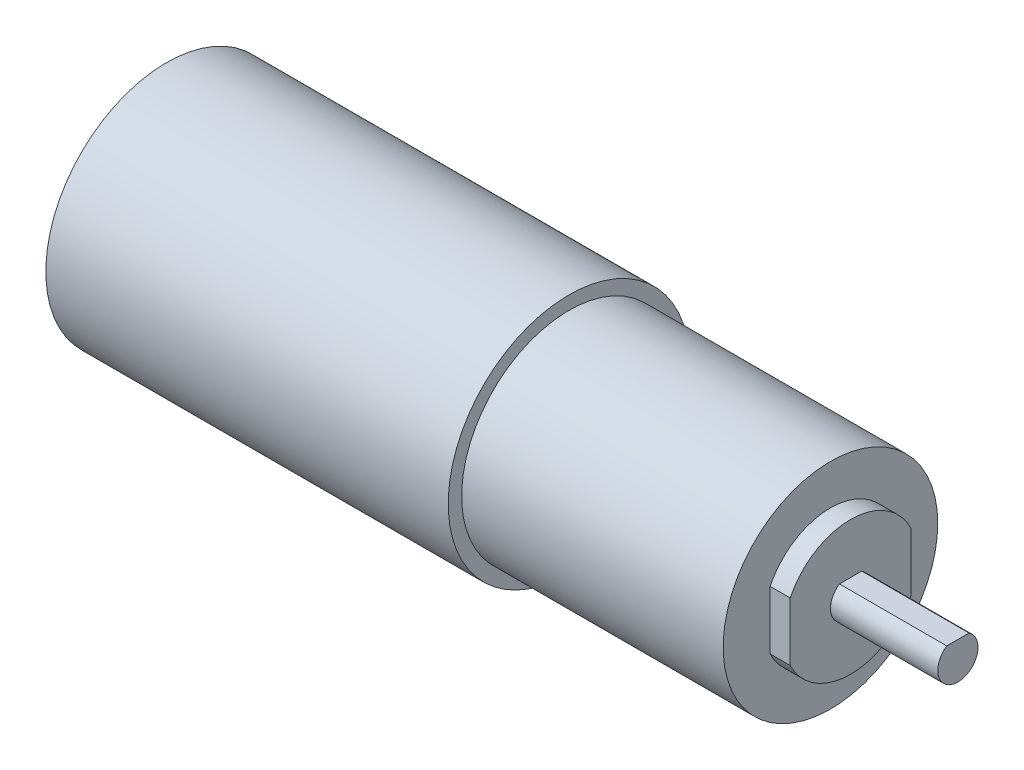
ISO-10303-21;
HEADER;
FILE_DESCRIPTION(('STEP AP214'),'2;1');
FILE_NAME('part.step','',(''),(''),'','','');
FILE_SCHEMA(('AUTOMOTIVE_DESIGN { 1 0 10303 214 1 1 1 1 }'));
ENDSEC;
DATA;
#1=APPLICATION_CONTEXT('core data for automotive mechanical design processes');
#2=APPLICATION_PROTOCOL_DEFINITION('international standard','automotive_design',2000,#1);
#3=PRODUCT_CONTEXT('',#1,'mechanical');
#4=PRODUCT('Part','Part','',(#3));
#5=PRODUCT_RELATED_PRODUCT_CATEGORY('part','',(#4));
#6=PRODUCT_DEFINITION_FORMATION('','',#4);
#7=PRODUCT_DEFINITION_CONTEXT('part definition',#1,'design');
#8=PRODUCT_DEFINITION('design','',#6,#7);
#9=PRODUCT_DEFINITION_SHAPE('','',#8);
#10=(LENGTH_UNIT() NAMED_UNIT(*) SI_UNIT(.MILLI.,.METRE.));
#11=(NAMED_UNIT(*) PLANE_ANGLE_UNIT() SI_UNIT($,.RADIAN.));
#12=(NAMED_UNIT(*) SI_UNIT($,.STERADIAN.) SOLID_ANGLE_UNIT());
#13=UNCERTAINTY_MEASURE_WITH_UNIT(LENGTH_MEASURE(1.E-05),#10,'distance_accuracy_value','');
#14=(GEOMETRIC_REPRESENTATION_CONTEXT(3) GLOBAL_UNCERTAINTY_ASSIGNED_CONTEXT((#13)) GLOBAL_UNIT_ASSIGNED_CONTEXT((#10,
#11,#12)) REPRESENTATION_CONTEXT('',''));
#15=CARTESIAN_POINT('',(0.,0.,0.));
#16=DIRECTION('',(0.,0.,1.));
#17=DIRECTION('',(1.,0.,0.));
#18=AXIS2_PLACEMENT_3D('',#15,#16,#17);
#19=CARTESIAN_POINT('',(60.,0.,0.));
#20=DIRECTION('',(-1.,0.,0.));
#21=DIRECTION('',(0.,0.,1.));
#22=AXIS2_PLACEMENT_3D('',#19,#20,#21);
#23=CYLINDRICAL_SURFACE('',#22,18.);
#24=CARTESIAN_POINT('',(60.,0.,0.));
#25=DIRECTION('',(1.,0.,0.));
#26=DIRECTION('',(0.,0.,-1.));
#27=AXIS2_PLACEMENT_3D('',#24,#25,#26);
#28=CIRCLE('',#27,18.);
#29=CARTESIAN_POINT('',(60.,0.,-18.));
#30=VERTEX_POINT('',#29);
#31=EDGE_CURVE('E144',#30,#30,#28,.T.);
#32=ORIENTED_EDGE('',*,*,#31,.F.);
#33=EDGE_LOOP('',(#32));
#34=FACE_BOUND('',#33,.T.);
#35=CARTESIAN_POINT('',(0.,0.,0.));
#36=DIRECTION('',(1.,0.,0.));
#37=DIRECTION('',(0.,0.,-1.));
#38=AXIS2_PLACEMENT_3D('',#35,#36,#37);
#39=CIRCLE('',#38,18.);
#40=CARTESIAN_POINT('',(0.,0.,-18.));
#41=VERTEX_POINT('',#40);
#42=EDGE_CURVE('E36',#41,#41,#39,.T.);
#43=ORIENTED_EDGE('',*,*,#42,.T.);
#44=EDGE_LOOP('',(#43));
#45=FACE_BOUND('',#44,.T.);
#46=ADVANCED_FACE('F33',(#34,#45),#23,.T.);
#47=CARTESIAN_POINT('',(60.,0.,0.));
#48=DIRECTION('',(1.,0.,0.));
#49=DIRECTION('',(0.,0.,-1.));
#50=AXIS2_PLACEMENT_3D('',#47,#48,#49);
#51=PLANE('',#50);
#52=CARTESIAN_POINT('',(60.,0.,0.));
#53=DIRECTION('',(1.,0.,0.));
#54=DIRECTION('',(0.,0.,-1.));
#55=AXIS2_PLACEMENT_3D('',#52,#53,#54);
#56=CIRCLE('',#55,16.);
#57=CARTESIAN_POINT('',(60.,0.,-16.));
#58=VERTEX_POINT('',#57);
#59=EDGE_CURVE('E11',#58,#58,#56,.T.);
#60=ORIENTED_EDGE('',*,*,#59,.F.);
#61=EDGE_LOOP('',(#60));
#62=FACE_BOUND('',#61,.T.);
#63=ORIENTED_EDGE('',*,*,#31,.T.);
#64=EDGE_LOOP('',(#63));
#65=FACE_BOUND('',#64,.T.);
#66=ADVANCED_FACE('F155',(#62,#65),#51,.T.);
#67=CARTESIAN_POINT('',(0.,0.,0.));
#68=DIRECTION('',(1.,0.,0.));
#69=DIRECTION('',(0.,0.,-1.));
#70=AXIS2_PLACEMENT_3D('',#67,#68,#69);
#71=PLANE('',#70);
#72=CARTESIAN_POINT('',(0.,0.,0.));
#73=DIRECTION('',(-1.,0.,0.));
#74=DIRECTION('',(0.,0.,1.));
#75=AXIS2_PLACEMENT_3D('',#72,#73,#74);
#76=CIRCLE('',#75,8.);
#77=CARTESIAN_POINT('',(0.,0.,8.));
#78=VERTEX_POINT('',#77);
#79=EDGE_CURVE('E41',#78,#78,#76,.T.);
#80=ORIENTED_EDGE('',*,*,#79,.F.);
#81=EDGE_LOOP('',(#80));
#82=FACE_BOUND('',#81,.T.);
#83=ORIENTED_EDGE('',*,*,#42,.F.);
#84=EDGE_LOOP('',(#83));
#85=FACE_BOUND('',#84,.T.);
#86=ADVANCED_FACE('F152',(#82,#85),#71,.F.);
#87=CARTESIAN_POINT('',(-3.,0.,0.));
#88=DIRECTION('',(1.,0.,0.));
#89=DIRECTION('',(0.,0.,-1.));
#90=AXIS2_PLACEMENT_3D('',#87,#88,#89);
#91=CYLINDRICAL_SURFACE('',#90,8.);
#92=CARTESIAN_POINT('',(-3.,0.,0.));
#93=DIRECTION('',(-1.,0.,0.));
#94=DIRECTION('',(0.,0.,1.));
#95=AXIS2_PLACEMENT_3D('',#92,#93,#94);
#96=CIRCLE('',#95,8.);
#97=CARTESIAN_POINT('',(-3.,0.,8.));
#98=VERTEX_POINT('',#97);
#99=EDGE_CURVE('E139',#98,#98,#96,.T.);
#100=ORIENTED_EDGE('',*,*,#99,.F.);
#101=EDGE_LOOP('',(#100));
#102=FACE_BOUND('',#101,.T.);
#103=ORIENTED_EDGE('',*,*,#79,.T.);
#104=EDGE_LOOP('',(#103));
#105=FACE_BOUND('',#104,.T.);
#106=ADVANCED_FACE('F154',(#102,#105),#91,.T.);
#107=CARTESIAN_POINT('',(-3.,0.,0.));
#108=DIRECTION('',(-1.,0.,0.));
#109=DIRECTION('',(0.,0.,1.));
#110=AXIS2_PLACEMENT_3D('',#107,#108,#109);
#111=PLANE('',#110);
#112=ORIENTED_EDGE('',*,*,#99,.T.);
#113=EDGE_LOOP('',(#112));
#114=FACE_BOUND('',#113,.T.);
#115=ADVANCED_FACE('F161',(#114),#111,.T.);
#116=CARTESIAN_POINT('',(99.,0.,0.));
#117=DIRECTION('',(-1.,0.,0.));
#118=DIRECTION('',(0.,0.,1.));
#119=AXIS2_PLACEMENT_3D('',#116,#117,#118);
#120=CYLINDRICAL_SURFACE('',#119,16.);
#121=CARTESIAN_POINT('',(99.,0.,0.));
#122=DIRECTION('',(1.,0.,0.));
#123=DIRECTION('',(0.,0.,-1.));
#124=AXIS2_PLACEMENT_3D('',#121,#122,#123);
#125=CIRCLE('',#124,16.);
#126=CARTESIAN_POINT('',(99.,0.,-16.));
#127=VERTEX_POINT('',#126);
#128=EDGE_CURVE('E137',#127,#127,#125,.T.);
#129=ORIENTED_EDGE('',*,*,#128,.F.);
#130=EDGE_LOOP('',(#129));
#131=FACE_BOUND('',#130,.T.);
#132=ORIENTED_EDGE('',*,*,#59,.T.);
#133=EDGE_LOOP('',(#132));
#134=FACE_BOUND('',#133,.T.);
#135=ADVANCED_FACE('F186',(#131,#134),#120,.T.);
#136=CARTESIAN_POINT('',(99.,0.,0.));
#137=DIRECTION('',(1.,0.,0.));
#138=DIRECTION('',(0.,0.,-1.));
#139=AXIS2_PLACEMENT_3D('',#136,#137,#138);
#140=PLANE('',#139);
#141=CARTESIAN_POINT('',(99.,0.,0.));
#142=DIRECTION('',(1.,0.,0.));
#143=DIRECTION('',(0.,0.,-1.));
#144=AXIS2_PLACEMENT_3D('',#141,#142,#143);
#145=CIRCLE('',#144,10.);
#146=CARTESIAN_POINT('',(99.,4.35889894354067,-9.));
#147=VERTEX_POINT('',#146);
#148=CARTESIAN_POINT('',(99.,4.35889894354068,9.));
#149=VERTEX_POINT('',#148);
#150=EDGE_CURVE('E56',#147,#149,#145,.T.);
#151=ORIENTED_EDGE('',*,*,#150,.F.);
#152=DIRECTION('',(0.,1.,0.));
#153=VECTOR('',#152,1.);
#154=CARTESIAN_POINT('',(99.,4.35889894354067,-9.));
#155=LINE('',#154,#153);
#156=CARTESIAN_POINT('',(99.,-4.35889894354067,-9.));
#157=VERTEX_POINT('',#156);
#158=EDGE_CURVE('E113',#157,#147,#155,.T.);
#159=ORIENTED_EDGE('',*,*,#158,.F.);
#160=CARTESIAN_POINT('',(99.,0.,0.));
#161=DIRECTION('',(1.,0.,0.));
#162=DIRECTION('',(0.,0.,-1.));
#163=AXIS2_PLACEMENT_3D('',#160,#161,#162);
#164=CIRCLE('',#163,10.);
#165=CARTESIAN_POINT('',(99.,-4.35889894354067,9.));
#166=VERTEX_POINT('',#165);
#167=EDGE_CURVE('E122',#166,#157,#164,.T.);
#168=ORIENTED_EDGE('',*,*,#167,.F.);
#169=DIRECTION('',(0.,-1.,0.));
#170=VECTOR('',#169,1.);
#171=CARTESIAN_POINT('',(99.,4.35889894354068,9.));
#172=LINE('',#171,#170);
#173=EDGE_CURVE('E104',#149,#166,#172,.T.);
#174=ORIENTED_EDGE('',*,*,#173,.F.);
#175=EDGE_LOOP('',(#151,#159,#168,#174));
#176=FACE_BOUND('',#175,.T.);
#177=ORIENTED_EDGE('',*,*,#128,.T.);
#178=EDGE_LOOP('',(#177));
#179=FACE_BOUND('',#178,.T.);
#180=ADVANCED_FACE('F191',(#176,#179),#140,.T.);
#181=CARTESIAN_POINT('',(102.,0.,0.));
#182=DIRECTION('',(-1.,0.,0.));
#183=DIRECTION('',(0.,0.,1.));
#184=AXIS2_PLACEMENT_3D('',#181,#182,#183);
#185=CYLINDRICAL_SURFACE('',#184,10.);
#186=ORIENTED_EDGE('',*,*,#150,.T.);
#187=DIRECTION('',(-1.,0.,0.));
#188=VECTOR('',#187,1.);
#189=CARTESIAN_POINT('',(102.,4.35889894354068,9.));
#190=LINE('',#189,#188);
#191=CARTESIAN_POINT('',(102.,4.35889894354068,9.));
#192=VERTEX_POINT('',#191);
#193=EDGE_CURVE('E134',#192,#149,#190,.T.);
#194=ORIENTED_EDGE('',*,*,#193,.F.);
#195=CARTESIAN_POINT('',(102.,0.,0.));
#196=DIRECTION('',(1.,0.,0.));
#197=DIRECTION('',(0.,0.,-1.));
#198=AXIS2_PLACEMENT_3D('',#195,#196,#197);
#199=CIRCLE('',#198,10.);
#200=CARTESIAN_POINT('',(102.,4.35889894354067,-9.));
#201=VERTEX_POINT('',#200);
#202=EDGE_CURVE('E109',#201,#192,#199,.T.);
#203=ORIENTED_EDGE('',*,*,#202,.F.);
#204=DIRECTION('',(-1.,0.,0.));
#205=VECTOR('',#204,1.);
#206=CARTESIAN_POINT('',(102.,4.35889894354067,-9.));
#207=LINE('',#206,#205);
#208=EDGE_CURVE('E118',#201,#147,#207,.T.);
#209=ORIENTED_EDGE('',*,*,#208,.T.);
#210=EDGE_LOOP('',(#186,#194,#203,#209));
#211=FACE_BOUND('',#210,.T.);
#212=ADVANCED_FACE('F201',(#211),#185,.T.);
#213=CARTESIAN_POINT('',(102.,4.35889894354068,9.));
#214=DIRECTION('',(0.,0.,-1.));
#215=DIRECTION('',(-1.,0.,0.));
#216=AXIS2_PLACEMENT_3D('',#213,#214,#215);
#217=PLANE('',#216);
#218=ORIENTED_EDGE('',*,*,#173,.T.);
#219=DIRECTION('',(-1.,0.,0.));
#220=VECTOR('',#219,1.);
#221=CARTESIAN_POINT('',(102.,-4.35889894354067,9.));
#222=LINE('',#221,#220);
#223=CARTESIAN_POINT('',(102.,-4.35889894354067,9.));
#224=VERTEX_POINT('',#223);
#225=EDGE_CURVE('E131',#224,#166,#222,.T.);
#226=ORIENTED_EDGE('',*,*,#225,.F.);
#227=DIRECTION('',(0.,-1.,0.));
#228=VECTOR('',#227,1.);
#229=CARTESIAN_POINT('',(102.,4.35889894354068,9.));
#230=LINE('',#229,#228);
#231=EDGE_CURVE('E112',#192,#224,#230,.T.);
#232=ORIENTED_EDGE('',*,*,#231,.F.);
#233=ORIENTED_EDGE('',*,*,#193,.T.);
#234=EDGE_LOOP('',(#218,#226,#232,#233));
#235=FACE_BOUND('',#234,.T.);
#236=ADVANCED_FACE('F210',(#235),#217,.F.);
#237=CARTESIAN_POINT('',(102.,0.,0.));
#238=DIRECTION('',(-1.,0.,0.));
#239=DIRECTION('',(0.,0.,1.));
#240=AXIS2_PLACEMENT_3D('',#237,#238,#239);
#241=CYLINDRICAL_SURFACE('',#240,10.);
#242=ORIENTED_EDGE('',*,*,#167,.T.);
#243=DIRECTION('',(-1.,0.,0.));
#244=VECTOR('',#243,1.);
#245=CARTESIAN_POINT('',(102.,-4.35889894354067,-9.));
#246=LINE('',#245,#244);
#247=CARTESIAN_POINT('',(102.,-4.35889894354067,-9.));
#248=VERTEX_POINT('',#247);
#249=EDGE_CURVE('E128',#248,#157,#246,.T.);
#250=ORIENTED_EDGE('',*,*,#249,.F.);
#251=CARTESIAN_POINT('',(102.,0.,0.));
#252=DIRECTION('',(1.,0.,0.));
#253=DIRECTION('',(0.,0.,-1.));
#254=AXIS2_PLACEMENT_3D('',#251,#252,#253);
#255=CIRCLE('',#254,10.);
#256=EDGE_CURVE('E115',#224,#248,#255,.T.);
#257=ORIENTED_EDGE('',*,*,#256,.F.);
#258=ORIENTED_EDGE('',*,*,#225,.T.);
#259=EDGE_LOOP('',(#242,#250,#257,#258));
#260=FACE_BOUND('',#259,.T.);
#261=ADVANCED_FACE('F220',(#260),#241,.T.);
#262=CARTESIAN_POINT('',(102.,4.35889894354067,-9.));
#263=DIRECTION('',(0.,0.,1.));
#264=DIRECTION('',(1.,0.,0.));
#265=AXIS2_PLACEMENT_3D('',#262,#263,#264);
#266=PLANE('',#265);
#267=ORIENTED_EDGE('',*,*,#158,.T.);
#268=ORIENTED_EDGE('',*,*,#208,.F.);
#269=DIRECTION('',(0.,1.,0.));
#270=VECTOR('',#269,1.);
#271=CARTESIAN_POINT('',(102.,4.35889894354067,-9.));
#272=LINE('',#271,#270);
#273=EDGE_CURVE('E117',#248,#201,#272,.T.);
#274=ORIENTED_EDGE('',*,*,#273,.F.);
#275=ORIENTED_EDGE('',*,*,#249,.T.);
#276=EDGE_LOOP('',(#267,#268,#274,#275));
#277=FACE_BOUND('',#276,.T.);
#278=ADVANCED_FACE('F230',(#277),#266,.F.);
#279=CARTESIAN_POINT('',(102.,0.,0.));
#280=DIRECTION('',(1.,0.,0.));
#281=DIRECTION('',(0.,0.,-1.));
#282=AXIS2_PLACEMENT_3D('',#279,#280,#281);
#283=PLANE('',#282);
#284=CARTESIAN_POINT('',(102.,0.,0.));
#285=DIRECTION('',(1.,0.,0.));
#286=DIRECTION('',(0.,0.,-1.));
#287=AXIS2_PLACEMENT_3D('',#284,#285,#286);
#288=CIRCLE('',#287,3.);
#289=CARTESIAN_POINT('',(102.,2.5,1.6583123951777));
#290=VERTEX_POINT('',#289);
#291=CARTESIAN_POINT('',(102.,2.5,-1.6583123951777));
#292=VERTEX_POINT('',#291);
#293=EDGE_CURVE('E102',#290,#292,#288,.T.);
#294=ORIENTED_EDGE('',*,*,#293,.F.);
#295=DIRECTION('',(0.,0.,1.));
#296=VECTOR('',#295,1.);
#297=CARTESIAN_POINT('',(102.,2.5,1.6583123951777));
#298=LINE('',#297,#296);
#299=EDGE_CURVE('E48',#292,#290,#298,.T.);
#300=ORIENTED_EDGE('',*,*,#299,.F.);
#301=EDGE_LOOP('',(#294,#300));
#302=FACE_BOUND('',#301,.T.);
#303=ORIENTED_EDGE('',*,*,#202,.T.);
#304=ORIENTED_EDGE('',*,*,#231,.T.);
#305=ORIENTED_EDGE('',*,*,#256,.T.);
#306=ORIENTED_EDGE('',*,*,#273,.T.);
#307=EDGE_LOOP('',(#303,#304,#305,#306));
#308=FACE_BOUND('',#307,.T.);
#309=ADVANCED_FACE('F240',(#302,#308),#283,.T.);
#310=CARTESIAN_POINT('',(118.,0.,0.));
#311=DIRECTION('',(-1.,0.,0.));
#312=DIRECTION('',(0.,0.,1.));
#313=AXIS2_PLACEMENT_3D('',#310,#311,#312);
#314=CYLINDRICAL_SURFACE('',#313,3.);
#315=ORIENTED_EDGE('',*,*,#293,.T.);
#316=DIRECTION('',(-1.,0.,0.));
#317=VECTOR('',#316,1.);
#318=CARTESIAN_POINT('',(118.,2.5,-1.6583123951777));
#319=LINE('',#318,#317);
#320=CARTESIAN_POINT('',(118.,2.5,-1.6583123951777));
#321=VERTEX_POINT('',#320);
#322=EDGE_CURVE('E90',#321,#292,#319,.T.);
#323=ORIENTED_EDGE('',*,*,#322,.F.);
#324=CARTESIAN_POINT('',(118.,0.,0.));
#325=DIRECTION('',(1.,0.,0.));
#326=DIRECTION('',(0.,0.,-1.));
#327=AXIS2_PLACEMENT_3D('',#324,#325,#326);
#328=CIRCLE('',#327,3.);
#329=CARTESIAN_POINT('',(118.,2.5,1.6583123951777));
#330=VERTEX_POINT('',#329);
#331=EDGE_CURVE('E96',#330,#321,#328,.T.);
#332=ORIENTED_EDGE('',*,*,#331,.F.);
#333=DIRECTION('',(-1.,0.,0.));
#334=VECTOR('',#333,1.);
#335=CARTESIAN_POINT('',(118.,2.5,1.6583123951777));
#336=LINE('',#335,#334);
#337=EDGE_CURVE('E93',#330,#290,#336,.T.);
#338=ORIENTED_EDGE('',*,*,#337,.T.);
#339=EDGE_LOOP('',(#315,#323,#332,#338));
#340=FACE_BOUND('',#339,.T.);
#341=ADVANCED_FACE('F101',(#340),#314,.T.);
#342=CARTESIAN_POINT('',(118.,2.5,1.6583123951777));
#343=DIRECTION('',(0.,-1.,0.));
#344=DIRECTION('',(0.,0.,-1.));
#345=AXIS2_PLACEMENT_3D('',#342,#343,#344);
#346=PLANE('',#345);
#347=ORIENTED_EDGE('',*,*,#299,.T.);
#348=ORIENTED_EDGE('',*,*,#337,.F.);
#349=DIRECTION('',(0.,0.,1.));
#350=VECTOR('',#349,1.);
#351=CARTESIAN_POINT('',(118.,2.5,1.6583123951777));
#352=LINE('',#351,#350);
#353=EDGE_CURVE('E86',#321,#330,#352,.T.);
#354=ORIENTED_EDGE('',*,*,#353,.F.);
#355=ORIENTED_EDGE('',*,*,#322,.T.);
#356=EDGE_LOOP('',(#347,#348,#354,#355));
#357=FACE_BOUND('',#356,.T.);
#358=ADVANCED_FACE('F88',(#357),#346,.F.);
#359=CARTESIAN_POINT('',(118.,0.,0.));
#360=DIRECTION('',(1.,0.,0.));
#361=DIRECTION('',(0.,0.,-1.));
#362=AXIS2_PLACEMENT_3D('',#359,#360,#361);
#363=PLANE('',#362);
#364=ORIENTED_EDGE('',*,*,#331,.T.);
#365=ORIENTED_EDGE('',*,*,#353,.T.);
#366=EDGE_LOOP('',(#364,#365));
#367=FACE_BOUND('',#366,.T.);
#368=ADVANCED_FACE('F98',(#367),#363,.T.);
#369=CLOSED_SHELL('',(#46,#66,#86,#106,#115,#135,#180,#212,#236,#261,#278,#309,#341,#358,#368));
#370=MANIFOLD_SOLID_BREP('B2',#369);
#371=ADVANCED_BREP_SHAPE_REPRESENTATION('',(#18,#370),#14);
#372=SHAPE_DEFINITION_REPRESENTATION(#9,#371);
ENDSEC;
END-ISO-10303-21;
